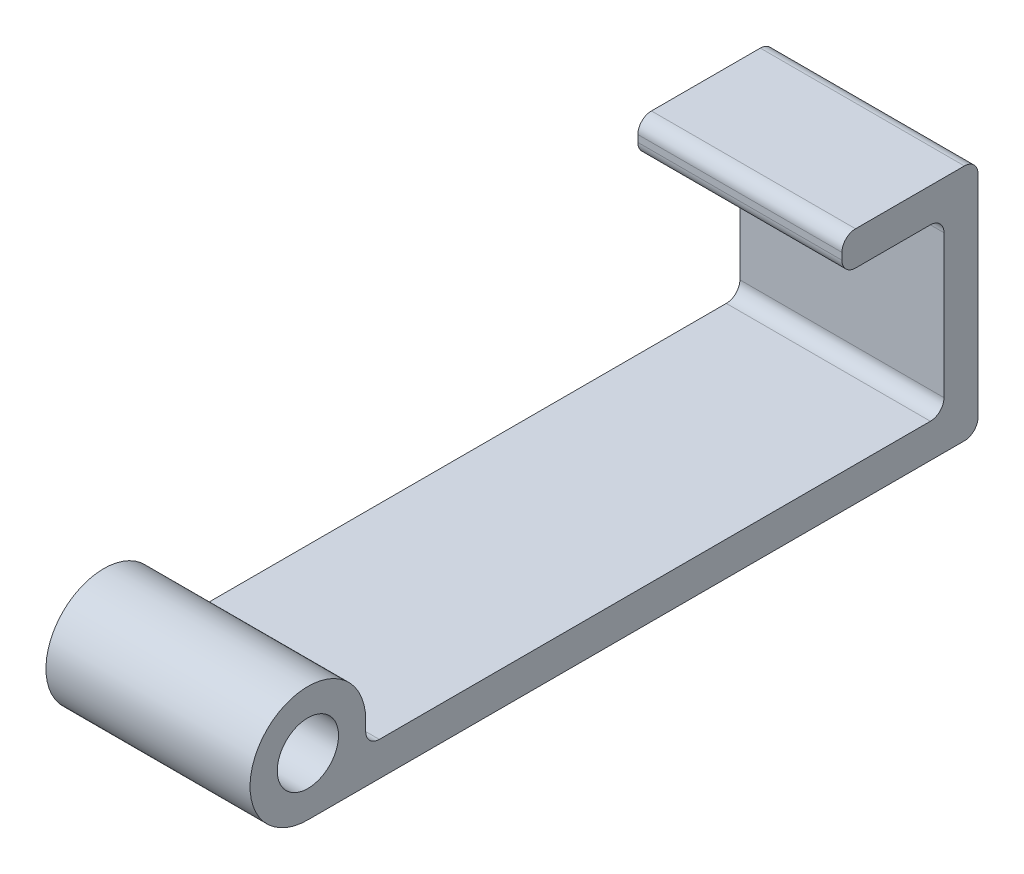
ISO-10303-21;
HEADER;
FILE_DESCRIPTION(('STEP AP214'),'2;1');
FILE_NAME('part.step','',(''),(''),'','','');
FILE_SCHEMA(('AUTOMOTIVE_DESIGN { 1 0 10303 214 1 1 1 1 }'));
ENDSEC;
DATA;
#1=APPLICATION_CONTEXT('core data for automotive mechanical design processes');
#2=APPLICATION_PROTOCOL_DEFINITION('international standard','automotive_design',2000,#1);
#3=PRODUCT_CONTEXT('',#1,'mechanical');
#4=PRODUCT('Part','Part','',(#3));
#5=PRODUCT_RELATED_PRODUCT_CATEGORY('part','',(#4));
#6=PRODUCT_DEFINITION_FORMATION('','',#4);
#7=PRODUCT_DEFINITION_CONTEXT('part definition',#1,'design');
#8=PRODUCT_DEFINITION('design','',#6,#7);
#9=PRODUCT_DEFINITION_SHAPE('','',#8);
#10=(LENGTH_UNIT() NAMED_UNIT(*) SI_UNIT(.MILLI.,.METRE.));
#11=(NAMED_UNIT(*) PLANE_ANGLE_UNIT() SI_UNIT($,.RADIAN.));
#12=(NAMED_UNIT(*) SI_UNIT($,.STERADIAN.) SOLID_ANGLE_UNIT());
#13=UNCERTAINTY_MEASURE_WITH_UNIT(LENGTH_MEASURE(1.E-05),#10,'distance_accuracy_value','');
#14=(GEOMETRIC_REPRESENTATION_CONTEXT(3) GLOBAL_UNCERTAINTY_ASSIGNED_CONTEXT((#13)) GLOBAL_UNIT_ASSIGNED_CONTEXT((#10,
#11,#12)) REPRESENTATION_CONTEXT('',''));
#15=CARTESIAN_POINT('',(0.,0.,0.));
#16=DIRECTION('',(0.,0.,1.));
#17=DIRECTION('',(1.,0.,0.));
#18=AXIS2_PLACEMENT_3D('',#15,#16,#17);
#19=CARTESIAN_POINT('',(-15.,5.,-42.5));
#20=DIRECTION('',(1.,0.,0.));
#21=DIRECTION('',(0.,0.,-1.));
#22=AXIS2_PLACEMENT_3D('',#19,#20,#21);
#23=PLANE('',#22);
#24=DIRECTION('',(0.,0.,1.));
#25=VECTOR('',#24,1.);
#26=CARTESIAN_POINT('',(-15.,30.,0.));
#27=LINE('',#26,#25);
#28=CARTESIAN_POINT('',(-15.,30.,-40.5));
#29=VERTEX_POINT('',#28);
#30=CARTESIAN_POINT('',(-15.,30.,-29.5));
#31=VERTEX_POINT('',#30);
#32=EDGE_CURVE('E267',#29,#31,#27,.T.);
#33=ORIENTED_EDGE('',*,*,#32,.T.);
#34=CARTESIAN_POINT('',(-15.,32.,-29.5));
#35=DIRECTION('',(1.,0.,0.));
#36=DIRECTION('',(0.,0.,-1.));
#37=AXIS2_PLACEMENT_3D('',#34,#35,#36);
#38=CIRCLE('',#37,2.);
#39=CARTESIAN_POINT('',(-15.,32.,-27.5));
#40=VERTEX_POINT('',#39);
#41=EDGE_CURVE('E234',#31,#40,#38,.F.);
#42=ORIENTED_EDGE('',*,*,#41,.T.);
#43=DIRECTION('',(0.,1.,0.));
#44=VECTOR('',#43,1.);
#45=CARTESIAN_POINT('',(-15.,0.,-27.5));
#46=LINE('',#45,#44);
#47=CARTESIAN_POINT('',(-15.,33.,-27.5));
#48=VERTEX_POINT('',#47);
#49=EDGE_CURVE('E294',#40,#48,#46,.T.);
#50=ORIENTED_EDGE('',*,*,#49,.T.);
#51=CARTESIAN_POINT('',(-15.,33.,-29.5));
#52=DIRECTION('',(1.,0.,0.));
#53=DIRECTION('',(0.,0.,-1.));
#54=AXIS2_PLACEMENT_3D('',#51,#52,#53);
#55=CIRCLE('',#54,2.);
#56=CARTESIAN_POINT('',(-15.,35.,-29.5));
#57=VERTEX_POINT('',#56);
#58=EDGE_CURVE('E229',#48,#57,#55,.F.);
#59=ORIENTED_EDGE('',*,*,#58,.T.);
#60=DIRECTION('',(0.,0.,1.));
#61=VECTOR('',#60,1.);
#62=CARTESIAN_POINT('',(-15.,35.,0.));
#63=LINE('',#62,#61);
#64=CARTESIAN_POINT('',(-15.,35.,-45.5));
#65=VERTEX_POINT('',#64);
#66=EDGE_CURVE('E291',#65,#57,#63,.T.);
#67=ORIENTED_EDGE('',*,*,#66,.F.);
#68=CARTESIAN_POINT('',(-15.,33.,-45.5));
#69=DIRECTION('',(1.,0.,0.));
#70=DIRECTION('',(0.,0.,-1.));
#71=AXIS2_PLACEMENT_3D('',#68,#69,#70);
#72=CIRCLE('',#71,2.);
#73=CARTESIAN_POINT('',(-15.,33.,-47.5));
#74=VERTEX_POINT('',#73);
#75=EDGE_CURVE('E54',#65,#74,#72,.F.);
#76=ORIENTED_EDGE('',*,*,#75,.T.);
#77=DIRECTION('',(0.,1.,0.));
#78=VECTOR('',#77,1.);
#79=CARTESIAN_POINT('',(-15.,0.,-47.5));
#80=LINE('',#79,#78);
#81=CARTESIAN_POINT('',(-15.,2.,-47.5));
#82=VERTEX_POINT('',#81);
#83=EDGE_CURVE('E289',#82,#74,#80,.T.);
#84=ORIENTED_EDGE('',*,*,#83,.F.);
#85=CARTESIAN_POINT('',(-15.,2.,-45.5));
#86=DIRECTION('',(1.,0.,0.));
#87=DIRECTION('',(0.,0.,-1.));
#88=AXIS2_PLACEMENT_3D('',#85,#86,#87);
#89=CIRCLE('',#88,2.);
#90=CARTESIAN_POINT('',(-15.,0.,-45.5));
#91=VERTEX_POINT('',#90);
#92=EDGE_CURVE('E232',#82,#91,#89,.F.);
#93=ORIENTED_EDGE('',*,*,#92,.T.);
#94=DIRECTION('',(0.,0.,1.));
#95=VECTOR('',#94,1.);
#96=CARTESIAN_POINT('',(-15.,0.,-42.5));
#97=LINE('',#96,#95);
#98=CARTESIAN_POINT('',(-15.,0.,51.));
#99=VERTEX_POINT('',#98);
#100=EDGE_CURVE('E177',#91,#99,#97,.T.);
#101=ORIENTED_EDGE('',*,*,#100,.T.);
#102=CARTESIAN_POINT('',(-15.,8.5,51.));
#103=DIRECTION('',(1.,0.,0.));
#104=DIRECTION('',(0.,0.,-1.));
#105=AXIS2_PLACEMENT_3D('',#102,#103,#104);
#106=CIRCLE('',#105,8.5);
#107=CARTESIAN_POINT('',(-15.,8.5,42.5));
#108=VERTEX_POINT('',#107);
#109=EDGE_CURVE('E163',#108,#99,#106,.T.);
#110=ORIENTED_EDGE('',*,*,#109,.F.);
#111=DIRECTION('',(0.,1.,0.));
#112=VECTOR('',#111,1.);
#113=CARTESIAN_POINT('',(-15.,0.,42.5));
#114=LINE('',#113,#112);
#115=CARTESIAN_POINT('',(-15.,7.,42.5));
#116=VERTEX_POINT('',#115);
#117=EDGE_CURVE('E153',#116,#108,#114,.T.);
#118=ORIENTED_EDGE('',*,*,#117,.F.);
#119=CARTESIAN_POINT('',(-15.,7.,40.5));
#120=DIRECTION('',(1.,0.,0.));
#121=DIRECTION('',(0.,0.,-1.));
#122=AXIS2_PLACEMENT_3D('',#119,#120,#121);
#123=CIRCLE('',#122,2.);
#124=CARTESIAN_POINT('',(-15.,5.,40.5));
#125=VERTEX_POINT('',#124);
#126=EDGE_CURVE('E250',#116,#125,#123,.T.);
#127=ORIENTED_EDGE('',*,*,#126,.T.);
#128=DIRECTION('',(0.,0.,1.));
#129=VECTOR('',#128,1.);
#130=CARTESIAN_POINT('',(-15.,5.,-42.5));
#131=LINE('',#130,#129);
#132=CARTESIAN_POINT('',(-15.,5.,-40.5));
#133=VERTEX_POINT('',#132);
#134=EDGE_CURVE('E190',#133,#125,#131,.T.);
#135=ORIENTED_EDGE('',*,*,#134,.F.);
#136=CARTESIAN_POINT('',(-15.,7.,-40.5));
#137=DIRECTION('',(1.,0.,0.));
#138=DIRECTION('',(0.,0.,-1.));
#139=AXIS2_PLACEMENT_3D('',#136,#137,#138);
#140=CIRCLE('',#139,2.);
#141=CARTESIAN_POINT('',(-15.,7.,-42.5));
#142=VERTEX_POINT('',#141);
#143=EDGE_CURVE('E47',#133,#142,#140,.T.);
#144=ORIENTED_EDGE('',*,*,#143,.T.);
#145=DIRECTION('',(0.,1.,0.));
#146=VECTOR('',#145,1.);
#147=CARTESIAN_POINT('',(-15.,0.,-42.5));
#148=LINE('',#147,#146);
#149=CARTESIAN_POINT('',(-15.,28.,-42.5));
#150=VERTEX_POINT('',#149);
#151=EDGE_CURVE('E186',#142,#150,#148,.T.);
#152=ORIENTED_EDGE('',*,*,#151,.T.);
#153=CARTESIAN_POINT('',(-15.,28.,-40.5));
#154=DIRECTION('',(1.,0.,0.));
#155=DIRECTION('',(0.,0.,-1.));
#156=AXIS2_PLACEMENT_3D('',#153,#154,#155);
#157=CIRCLE('',#156,2.);
#158=EDGE_CURVE('E254',#150,#29,#157,.T.);
#159=ORIENTED_EDGE('',*,*,#158,.T.);
#160=EDGE_LOOP('',(#33,#42,#50,#59,#67,#76,#84,#93,#101,#110,#118,#127,#135,#144,#152,#159));
#161=FACE_BOUND('',#160,.T.);
#162=CARTESIAN_POINT('',(-15.,8.5,51.));
#163=DIRECTION('',(1.,0.,0.));
#164=DIRECTION('',(0.,0.,-1.));
#165=AXIS2_PLACEMENT_3D('',#162,#163,#164);
#166=CIRCLE('',#165,4.5);
#167=CARTESIAN_POINT('',(-15.,8.5,46.5));
#168=VERTEX_POINT('',#167);
#169=EDGE_CURVE('E164',#168,#168,#166,.T.);
#170=ORIENTED_EDGE('',*,*,#169,.T.);
#171=EDGE_LOOP('',(#170));
#172=FACE_BOUND('',#171,.T.);
#173=ADVANCED_FACE('F39',(#161,#172),#23,.F.);
#174=CARTESIAN_POINT('',(15.,5.,-42.5));
#175=DIRECTION('',(-1.,0.,0.));
#176=DIRECTION('',(0.,0.,1.));
#177=AXIS2_PLACEMENT_3D('',#174,#175,#176);
#178=PLANE('',#177);
#179=DIRECTION('',(0.,1.,0.));
#180=VECTOR('',#179,1.);
#181=CARTESIAN_POINT('',(15.,0.,-27.5));
#182=LINE('',#181,#180);
#183=CARTESIAN_POINT('',(15.,32.,-27.5));
#184=VERTEX_POINT('',#183);
#185=CARTESIAN_POINT('',(15.,33.,-27.5));
#186=VERTEX_POINT('',#185);
#187=EDGE_CURVE('E307',#184,#186,#182,.T.);
#188=ORIENTED_EDGE('',*,*,#187,.F.);
#189=CARTESIAN_POINT('',(15.,32.,-29.5));
#190=DIRECTION('',(-1.,0.,0.));
#191=DIRECTION('',(0.,0.,1.));
#192=AXIS2_PLACEMENT_3D('',#189,#190,#191);
#193=CIRCLE('',#192,2.);
#194=CARTESIAN_POINT('',(15.,30.,-29.5));
#195=VERTEX_POINT('',#194);
#196=EDGE_CURVE('E227',#184,#195,#193,.F.);
#197=ORIENTED_EDGE('',*,*,#196,.T.);
#198=DIRECTION('',(0.,0.,1.));
#199=VECTOR('',#198,1.);
#200=CARTESIAN_POINT('',(15.,30.,0.));
#201=LINE('',#200,#199);
#202=CARTESIAN_POINT('',(15.,30.,-40.5));
#203=VERTEX_POINT('',#202);
#204=EDGE_CURVE('E296',#203,#195,#201,.T.);
#205=ORIENTED_EDGE('',*,*,#204,.F.);
#206=CARTESIAN_POINT('',(15.,28.,-40.5));
#207=DIRECTION('',(-1.,0.,0.));
#208=DIRECTION('',(0.,0.,1.));
#209=AXIS2_PLACEMENT_3D('',#206,#207,#208);
#210=CIRCLE('',#209,2.);
#211=CARTESIAN_POINT('',(15.,28.,-42.5));
#212=VERTEX_POINT('',#211);
#213=EDGE_CURVE('E252',#203,#212,#210,.T.);
#214=ORIENTED_EDGE('',*,*,#213,.T.);
#215=DIRECTION('',(0.,1.,0.));
#216=VECTOR('',#215,1.);
#217=CARTESIAN_POINT('',(15.,0.,-42.5));
#218=LINE('',#217,#216);
#219=CARTESIAN_POINT('',(15.,7.,-42.5));
#220=VERTEX_POINT('',#219);
#221=EDGE_CURVE('E276',#220,#212,#218,.T.);
#222=ORIENTED_EDGE('',*,*,#221,.F.);
#223=CARTESIAN_POINT('',(15.,7.,-40.5));
#224=DIRECTION('',(-1.,0.,0.));
#225=DIRECTION('',(0.,0.,1.));
#226=AXIS2_PLACEMENT_3D('',#223,#224,#225);
#227=CIRCLE('',#226,2.);
#228=CARTESIAN_POINT('',(15.,5.,-40.5));
#229=VERTEX_POINT('',#228);
#230=EDGE_CURVE('E11',#220,#229,#227,.T.);
#231=ORIENTED_EDGE('',*,*,#230,.T.);
#232=DIRECTION('',(0.,0.,-1.));
#233=VECTOR('',#232,1.);
#234=CARTESIAN_POINT('',(15.,5.,-42.5));
#235=LINE('',#234,#233);
#236=CARTESIAN_POINT('',(15.,5.,40.5));
#237=VERTEX_POINT('',#236);
#238=EDGE_CURVE('E193',#237,#229,#235,.T.);
#239=ORIENTED_EDGE('',*,*,#238,.F.);
#240=CARTESIAN_POINT('',(15.,7.,40.5));
#241=DIRECTION('',(-1.,0.,0.));
#242=DIRECTION('',(0.,0.,1.));
#243=AXIS2_PLACEMENT_3D('',#240,#241,#242);
#244=CIRCLE('',#243,2.);
#245=CARTESIAN_POINT('',(15.,7.,42.5));
#246=VERTEX_POINT('',#245);
#247=EDGE_CURVE('E248',#237,#246,#244,.T.);
#248=ORIENTED_EDGE('',*,*,#247,.T.);
#249=DIRECTION('',(0.,1.,0.));
#250=VECTOR('',#249,1.);
#251=CARTESIAN_POINT('',(15.,0.,42.5));
#252=LINE('',#251,#250);
#253=CARTESIAN_POINT('',(15.,8.5,42.5));
#254=VERTEX_POINT('',#253);
#255=EDGE_CURVE('E185',#246,#254,#252,.T.);
#256=ORIENTED_EDGE('',*,*,#255,.T.);
#257=CARTESIAN_POINT('',(15.,8.5,51.));
#258=DIRECTION('',(1.,0.,0.));
#259=DIRECTION('',(0.,0.,-1.));
#260=AXIS2_PLACEMENT_3D('',#257,#258,#259);
#261=CIRCLE('',#260,8.5);
#262=CARTESIAN_POINT('',(15.,0.,51.));
#263=VERTEX_POINT('',#262);
#264=EDGE_CURVE('E171',#254,#263,#261,.T.);
#265=ORIENTED_EDGE('',*,*,#264,.T.);
#266=DIRECTION('',(0.,0.,-1.));
#267=VECTOR('',#266,1.);
#268=CARTESIAN_POINT('',(15.,0.,-42.5));
#269=LINE('',#268,#267);
#270=CARTESIAN_POINT('',(15.,0.,-45.5));
#271=VERTEX_POINT('',#270);
#272=EDGE_CURVE('E194',#263,#271,#269,.T.);
#273=ORIENTED_EDGE('',*,*,#272,.T.);
#274=CARTESIAN_POINT('',(15.,2.,-45.5));
#275=DIRECTION('',(-1.,0.,0.));
#276=DIRECTION('',(0.,0.,1.));
#277=AXIS2_PLACEMENT_3D('',#274,#275,#276);
#278=CIRCLE('',#277,2.);
#279=CARTESIAN_POINT('',(15.,2.,-47.5));
#280=VERTEX_POINT('',#279);
#281=EDGE_CURVE('E225',#271,#280,#278,.F.);
#282=ORIENTED_EDGE('',*,*,#281,.T.);
#283=DIRECTION('',(0.,1.,0.));
#284=VECTOR('',#283,1.);
#285=CARTESIAN_POINT('',(15.,0.,-47.5));
#286=LINE('',#285,#284);
#287=CARTESIAN_POINT('',(15.,33.,-47.5));
#288=VERTEX_POINT('',#287);
#289=EDGE_CURVE('E302',#280,#288,#286,.T.);
#290=ORIENTED_EDGE('',*,*,#289,.T.);
#291=CARTESIAN_POINT('',(15.,33.,-45.5));
#292=DIRECTION('',(-1.,0.,0.));
#293=DIRECTION('',(0.,0.,1.));
#294=AXIS2_PLACEMENT_3D('',#291,#292,#293);
#295=CIRCLE('',#294,2.);
#296=CARTESIAN_POINT('',(15.,35.,-45.5));
#297=VERTEX_POINT('',#296);
#298=EDGE_CURVE('E223',#288,#297,#295,.F.);
#299=ORIENTED_EDGE('',*,*,#298,.T.);
#300=DIRECTION('',(0.,0.,1.));
#301=VECTOR('',#300,1.);
#302=CARTESIAN_POINT('',(15.,35.,0.));
#303=LINE('',#302,#301);
#304=CARTESIAN_POINT('',(15.,35.,-29.5));
#305=VERTEX_POINT('',#304);
#306=EDGE_CURVE('E304',#297,#305,#303,.T.);
#307=ORIENTED_EDGE('',*,*,#306,.T.);
#308=CARTESIAN_POINT('',(15.,33.,-29.5));
#309=DIRECTION('',(-1.,0.,0.));
#310=DIRECTION('',(0.,0.,1.));
#311=AXIS2_PLACEMENT_3D('',#308,#309,#310);
#312=CIRCLE('',#311,2.);
#313=EDGE_CURVE('E221',#305,#186,#312,.F.);
#314=ORIENTED_EDGE('',*,*,#313,.T.);
#315=EDGE_LOOP('',(#188,#197,#205,#214,#222,#231,#239,#248,#256,#265,#273,#282,#290,#299,#307,#314));
#316=FACE_BOUND('',#315,.T.);
#317=CARTESIAN_POINT('',(15.,8.5,51.));
#318=DIRECTION('',(1.,0.,0.));
#319=DIRECTION('',(0.,0.,-1.));
#320=AXIS2_PLACEMENT_3D('',#317,#318,#319);
#321=CIRCLE('',#320,4.5);
#322=CARTESIAN_POINT('',(15.,8.5,46.5));
#323=VERTEX_POINT('',#322);
#324=EDGE_CURVE('E182',#323,#323,#321,.T.);
#325=ORIENTED_EDGE('',*,*,#324,.F.);
#326=EDGE_LOOP('',(#325));
#327=FACE_BOUND('',#326,.T.);
#328=ADVANCED_FACE('F274',(#316,#327),#178,.F.);
#329=CARTESIAN_POINT('',(0.,5.,0.));
#330=DIRECTION('',(0.,1.,0.));
#331=DIRECTION('',(0.,0.,1.));
#332=AXIS2_PLACEMENT_3D('',#329,#330,#331);
#333=PLANE('',#332);
#334=ORIENTED_EDGE('',*,*,#134,.T.);
#335=DIRECTION('',(1.,0.,0.));
#336=VECTOR('',#335,1.);
#337=CARTESIAN_POINT('',(15.,5.,40.5));
#338=LINE('',#337,#336);
#339=EDGE_CURVE('E203',#125,#237,#338,.T.);
#340=ORIENTED_EDGE('',*,*,#339,.T.);
#341=ORIENTED_EDGE('',*,*,#238,.T.);
#342=DIRECTION('',(-1.,0.,0.));
#343=VECTOR('',#342,1.);
#344=CARTESIAN_POINT('',(0.,5.,-40.5));
#345=LINE('',#344,#343);
#346=EDGE_CURVE('E197',#229,#133,#345,.T.);
#347=ORIENTED_EDGE('',*,*,#346,.T.);
#348=EDGE_LOOP('',(#334,#340,#341,#347));
#349=FACE_BOUND('',#348,.T.);
#350=ADVANCED_FACE('F278',(#349),#333,.T.);
#351=CARTESIAN_POINT('',(0.,0.,0.));
#352=DIRECTION('',(0.,1.,0.));
#353=DIRECTION('',(0.,0.,1.));
#354=AXIS2_PLACEMENT_3D('',#351,#352,#353);
#355=PLANE('',#354);
#356=ORIENTED_EDGE('',*,*,#100,.F.);
#357=DIRECTION('',(1.,0.,0.));
#358=VECTOR('',#357,1.);
#359=CARTESIAN_POINT('',(15.,0.,-45.5));
#360=LINE('',#359,#358);
#361=EDGE_CURVE('E236',#91,#271,#360,.T.);
#362=ORIENTED_EDGE('',*,*,#361,.T.);
#363=ORIENTED_EDGE('',*,*,#272,.F.);
#364=DIRECTION('',(1.,0.,0.));
#365=VECTOR('',#364,1.);
#366=CARTESIAN_POINT('',(-15.,0.,51.));
#367=LINE('',#366,#365);
#368=EDGE_CURVE('E172',#99,#263,#367,.T.);
#369=ORIENTED_EDGE('',*,*,#368,.F.);
#370=EDGE_LOOP('',(#356,#362,#363,#369));
#371=FACE_BOUND('',#370,.T.);
#372=ADVANCED_FACE('F284',(#371),#355,.F.);
#373=CARTESIAN_POINT('',(-15.,0.,42.5));
#374=DIRECTION('',(0.,0.,-1.));
#375=DIRECTION('',(-1.,0.,0.));
#376=AXIS2_PLACEMENT_3D('',#373,#374,#375);
#377=PLANE('',#376);
#378=ORIENTED_EDGE('',*,*,#255,.F.);
#379=DIRECTION('',(1.,0.,0.));
#380=VECTOR('',#379,1.);
#381=CARTESIAN_POINT('',(-15.,7.,42.5));
#382=LINE('',#381,#380);
#383=EDGE_CURVE('E160',#246,#116,#382,.F.);
#384=ORIENTED_EDGE('',*,*,#383,.T.);
#385=ORIENTED_EDGE('',*,*,#117,.T.);
#386=DIRECTION('',(1.,0.,0.));
#387=VECTOR('',#386,1.);
#388=CARTESIAN_POINT('',(-15.,8.5,42.5));
#389=LINE('',#388,#387);
#390=EDGE_CURVE('E157',#108,#254,#389,.T.);
#391=ORIENTED_EDGE('',*,*,#390,.T.);
#392=EDGE_LOOP('',(#378,#384,#385,#391));
#393=FACE_BOUND('',#392,.T.);
#394=ADVANCED_FACE('F156',(#393),#377,.T.);
#395=CARTESIAN_POINT('',(-15.,8.5,51.));
#396=DIRECTION('',(1.,0.,0.));
#397=DIRECTION('',(0.,0.,-1.));
#398=AXIS2_PLACEMENT_3D('',#395,#396,#397);
#399=CYLINDRICAL_SURFACE('',#398,4.5);
#400=ORIENTED_EDGE('',*,*,#169,.F.);
#401=EDGE_LOOP('',(#400));
#402=FACE_BOUND('',#401,.T.);
#403=ORIENTED_EDGE('',*,*,#324,.T.);
#404=EDGE_LOOP('',(#403));
#405=FACE_BOUND('',#404,.T.);
#406=ADVANCED_FACE('F314',(#402,#405),#399,.F.);
#407=CARTESIAN_POINT('',(-15.,8.5,51.));
#408=DIRECTION('',(1.,0.,0.));
#409=DIRECTION('',(0.,0.,-1.));
#410=AXIS2_PLACEMENT_3D('',#407,#408,#409);
#411=CYLINDRICAL_SURFACE('',#410,8.5);
#412=ORIENTED_EDGE('',*,*,#264,.F.);
#413=ORIENTED_EDGE('',*,*,#390,.F.);
#414=ORIENTED_EDGE('',*,*,#109,.T.);
#415=ORIENTED_EDGE('',*,*,#368,.T.);
#416=EDGE_LOOP('',(#412,#413,#414,#415));
#417=FACE_BOUND('',#416,.T.);
#418=ADVANCED_FACE('F168',(#417),#411,.T.);
#419=CARTESIAN_POINT('',(-15.,0.,-42.5));
#420=DIRECTION('',(0.,0.,-1.));
#421=DIRECTION('',(-1.,0.,0.));
#422=AXIS2_PLACEMENT_3D('',#419,#420,#421);
#423=PLANE('',#422);
#424=ORIENTED_EDGE('',*,*,#221,.T.);
#425=DIRECTION('',(1.,0.,0.));
#426=VECTOR('',#425,1.);
#427=CARTESIAN_POINT('',(-15.,28.,-42.5));
#428=LINE('',#427,#426);
#429=EDGE_CURVE('E214',#212,#150,#428,.F.);
#430=ORIENTED_EDGE('',*,*,#429,.T.);
#431=ORIENTED_EDGE('',*,*,#151,.F.);
#432=DIRECTION('',(-1.,0.,0.));
#433=VECTOR('',#432,1.);
#434=CARTESIAN_POINT('',(-15.,7.,-42.5));
#435=LINE('',#434,#433);
#436=EDGE_CURVE('E212',#142,#220,#435,.F.);
#437=ORIENTED_EDGE('',*,*,#436,.T.);
#438=EDGE_LOOP('',(#424,#430,#431,#437));
#439=FACE_BOUND('',#438,.T.);
#440=ADVANCED_FACE('F264',(#439),#423,.F.);
#441=CARTESIAN_POINT('',(-15.,30.,0.));
#442=DIRECTION('',(0.,1.,0.));
#443=DIRECTION('',(0.,0.,1.));
#444=AXIS2_PLACEMENT_3D('',#441,#442,#443);
#445=PLANE('',#444);
#446=ORIENTED_EDGE('',*,*,#32,.F.);
#447=DIRECTION('',(1.,0.,0.));
#448=VECTOR('',#447,1.);
#449=CARTESIAN_POINT('',(15.,30.,-40.5));
#450=LINE('',#449,#448);
#451=EDGE_CURVE('E209',#29,#203,#450,.T.);
#452=ORIENTED_EDGE('',*,*,#451,.T.);
#453=ORIENTED_EDGE('',*,*,#204,.T.);
#454=DIRECTION('',(1.,0.,0.));
#455=VECTOR('',#454,1.);
#456=CARTESIAN_POINT('',(-15.,30.,-29.5));
#457=LINE('',#456,#455);
#458=EDGE_CURVE('E207',#195,#31,#457,.F.);
#459=ORIENTED_EDGE('',*,*,#458,.T.);
#460=EDGE_LOOP('',(#446,#452,#453,#459));
#461=FACE_BOUND('',#460,.T.);
#462=ADVANCED_FACE('F366',(#461),#445,.F.);
#463=CARTESIAN_POINT('',(-15.,0.,-27.5));
#464=DIRECTION('',(0.,0.,-1.));
#465=DIRECTION('',(-1.,0.,0.));
#466=AXIS2_PLACEMENT_3D('',#463,#464,#465);
#467=PLANE('',#466);
#468=ORIENTED_EDGE('',*,*,#49,.F.);
#469=DIRECTION('',(1.,0.,0.));
#470=VECTOR('',#469,1.);
#471=CARTESIAN_POINT('',(-15.,32.,-27.5));
#472=LINE('',#471,#470);
#473=EDGE_CURVE('E218',#40,#184,#472,.T.);
#474=ORIENTED_EDGE('',*,*,#473,.T.);
#475=ORIENTED_EDGE('',*,*,#187,.T.);
#476=DIRECTION('',(1.,0.,0.));
#477=VECTOR('',#476,1.);
#478=CARTESIAN_POINT('',(-15.,33.,-27.5));
#479=LINE('',#478,#477);
#480=EDGE_CURVE('E216',#186,#48,#479,.F.);
#481=ORIENTED_EDGE('',*,*,#480,.T.);
#482=EDGE_LOOP('',(#468,#474,#475,#481));
#483=FACE_BOUND('',#482,.T.);
#484=ADVANCED_FACE('F359',(#483),#467,.F.);
#485=CARTESIAN_POINT('',(-15.,35.,0.));
#486=DIRECTION('',(0.,1.,0.));
#487=DIRECTION('',(0.,0.,1.));
#488=AXIS2_PLACEMENT_3D('',#485,#486,#487);
#489=PLANE('',#488);
#490=ORIENTED_EDGE('',*,*,#306,.F.);
#491=DIRECTION('',(1.,0.,0.));
#492=VECTOR('',#491,1.);
#493=CARTESIAN_POINT('',(-15.,35.,-45.5));
#494=LINE('',#493,#492);
#495=EDGE_CURVE('E246',#297,#65,#494,.F.);
#496=ORIENTED_EDGE('',*,*,#495,.T.);
#497=ORIENTED_EDGE('',*,*,#66,.T.);
#498=DIRECTION('',(1.,0.,0.));
#499=VECTOR('',#498,1.);
#500=CARTESIAN_POINT('',(15.,35.,-29.5));
#501=LINE('',#500,#499);
#502=EDGE_CURVE('E243',#57,#305,#501,.T.);
#503=ORIENTED_EDGE('',*,*,#502,.T.);
#504=EDGE_LOOP('',(#490,#496,#497,#503));
#505=FACE_BOUND('',#504,.T.);
#506=ADVANCED_FACE('F353',(#505),#489,.T.);
#507=CARTESIAN_POINT('',(-15.,0.,-47.5));
#508=DIRECTION('',(0.,0.,-1.));
#509=DIRECTION('',(-1.,0.,0.));
#510=AXIS2_PLACEMENT_3D('',#507,#508,#509);
#511=PLANE('',#510);
#512=ORIENTED_EDGE('',*,*,#289,.F.);
#513=DIRECTION('',(1.,0.,0.));
#514=VECTOR('',#513,1.);
#515=CARTESIAN_POINT('',(-15.,2.,-47.5));
#516=LINE('',#515,#514);
#517=EDGE_CURVE('E61',#280,#82,#516,.F.);
#518=ORIENTED_EDGE('',*,*,#517,.T.);
#519=ORIENTED_EDGE('',*,*,#83,.T.);
#520=DIRECTION('',(1.,0.,0.));
#521=VECTOR('',#520,1.);
#522=CARTESIAN_POINT('',(-15.,33.,-47.5));
#523=LINE('',#522,#521);
#524=EDGE_CURVE('E239',#74,#288,#523,.T.);
#525=ORIENTED_EDGE('',*,*,#524,.T.);
#526=EDGE_LOOP('',(#512,#518,#519,#525));
#527=FACE_BOUND('',#526,.T.);
#528=ADVANCED_FACE('F332',(#527),#511,.T.);
#529=CARTESIAN_POINT('',(0.,7.,40.5));
#530=DIRECTION('',(-1.,0.,0.));
#531=DIRECTION('',(0.,0.,1.));
#532=AXIS2_PLACEMENT_3D('',#529,#530,#531);
#533=CYLINDRICAL_SURFACE('',#532,2.);
#534=ORIENTED_EDGE('',*,*,#126,.F.);
#535=ORIENTED_EDGE('',*,*,#383,.F.);
#536=ORIENTED_EDGE('',*,*,#247,.F.);
#537=ORIENTED_EDGE('',*,*,#339,.F.);
#538=EDGE_LOOP('',(#534,#535,#536,#537));
#539=FACE_BOUND('',#538,.T.);
#540=ADVANCED_FACE('F281',(#539),#533,.F.);
#541=CARTESIAN_POINT('',(-15.,28.,-40.5));
#542=DIRECTION('',(-1.,0.,0.));
#543=DIRECTION('',(0.,0.,1.));
#544=AXIS2_PLACEMENT_3D('',#541,#542,#543);
#545=CYLINDRICAL_SURFACE('',#544,2.);
#546=ORIENTED_EDGE('',*,*,#158,.F.);
#547=ORIENTED_EDGE('',*,*,#429,.F.);
#548=ORIENTED_EDGE('',*,*,#213,.F.);
#549=ORIENTED_EDGE('',*,*,#451,.F.);
#550=EDGE_LOOP('',(#546,#547,#548,#549));
#551=FACE_BOUND('',#550,.T.);
#552=ADVANCED_FACE('F331',(#551),#545,.F.);
#553=CARTESIAN_POINT('',(0.,7.,-40.5));
#554=DIRECTION('',(-1.,0.,0.));
#555=DIRECTION('',(0.,0.,1.));
#556=AXIS2_PLACEMENT_3D('',#553,#554,#555);
#557=CYLINDRICAL_SURFACE('',#556,2.);
#558=ORIENTED_EDGE('',*,*,#230,.F.);
#559=ORIENTED_EDGE('',*,*,#436,.F.);
#560=ORIENTED_EDGE('',*,*,#143,.F.);
#561=ORIENTED_EDGE('',*,*,#346,.F.);
#562=EDGE_LOOP('',(#558,#559,#560,#561));
#563=FACE_BOUND('',#562,.T.);
#564=ADVANCED_FACE('F270',(#563),#557,.F.);
#565=CARTESIAN_POINT('',(-15.,32.,-29.5));
#566=DIRECTION('',(1.,0.,0.));
#567=DIRECTION('',(0.,0.,-1.));
#568=AXIS2_PLACEMENT_3D('',#565,#566,#567);
#569=CYLINDRICAL_SURFACE('',#568,2.);
#570=ORIENTED_EDGE('',*,*,#41,.F.);
#571=ORIENTED_EDGE('',*,*,#458,.F.);
#572=ORIENTED_EDGE('',*,*,#196,.F.);
#573=ORIENTED_EDGE('',*,*,#473,.F.);
#574=EDGE_LOOP('',(#570,#571,#572,#573));
#575=FACE_BOUND('',#574,.T.);
#576=ADVANCED_FACE('F338',(#575),#569,.T.);
#577=CARTESIAN_POINT('',(0.,2.,-45.5));
#578=DIRECTION('',(-1.,0.,0.));
#579=DIRECTION('',(0.,0.,1.));
#580=AXIS2_PLACEMENT_3D('',#577,#578,#579);
#581=CYLINDRICAL_SURFACE('',#580,2.);
#582=ORIENTED_EDGE('',*,*,#92,.F.);
#583=ORIENTED_EDGE('',*,*,#517,.F.);
#584=ORIENTED_EDGE('',*,*,#281,.F.);
#585=ORIENTED_EDGE('',*,*,#361,.F.);
#586=EDGE_LOOP('',(#582,#583,#584,#585));
#587=FACE_BOUND('',#586,.T.);
#588=ADVANCED_FACE('F288',(#587),#581,.T.);
#589=CARTESIAN_POINT('',(-15.,33.,-45.5));
#590=DIRECTION('',(1.,0.,0.));
#591=DIRECTION('',(0.,0.,-1.));
#592=AXIS2_PLACEMENT_3D('',#589,#590,#591);
#593=CYLINDRICAL_SURFACE('',#592,2.);
#594=ORIENTED_EDGE('',*,*,#75,.F.);
#595=ORIENTED_EDGE('',*,*,#495,.F.);
#596=ORIENTED_EDGE('',*,*,#298,.F.);
#597=ORIENTED_EDGE('',*,*,#524,.F.);
#598=EDGE_LOOP('',(#594,#595,#596,#597));
#599=FACE_BOUND('',#598,.T.);
#600=ADVANCED_FACE('F343',(#599),#593,.T.);
#601=CARTESIAN_POINT('',(-15.,33.,-29.5));
#602=DIRECTION('',(-1.,0.,0.));
#603=DIRECTION('',(0.,0.,1.));
#604=AXIS2_PLACEMENT_3D('',#601,#602,#603);
#605=CYLINDRICAL_SURFACE('',#604,2.);
#606=ORIENTED_EDGE('',*,*,#58,.F.);
#607=ORIENTED_EDGE('',*,*,#480,.F.);
#608=ORIENTED_EDGE('',*,*,#313,.F.);
#609=ORIENTED_EDGE('',*,*,#502,.F.);
#610=EDGE_LOOP('',(#606,#607,#608,#609));
#611=FACE_BOUND('',#610,.T.);
#612=ADVANCED_FACE('F41',(#611),#605,.T.);
#613=CLOSED_SHELL('',(#173,#328,#350,#372,#394,#406,#418,#440,#462,#484,#506,#528,#540,#552,
#564,#576,#588,#600,#612));
#614=MANIFOLD_SOLID_BREP('B2',#613);
#615=ADVANCED_BREP_SHAPE_REPRESENTATION('',(#18,#614),#14);
#616=SHAPE_DEFINITION_REPRESENTATION(#9,#615);
ENDSEC;
END-ISO-10303-21;
